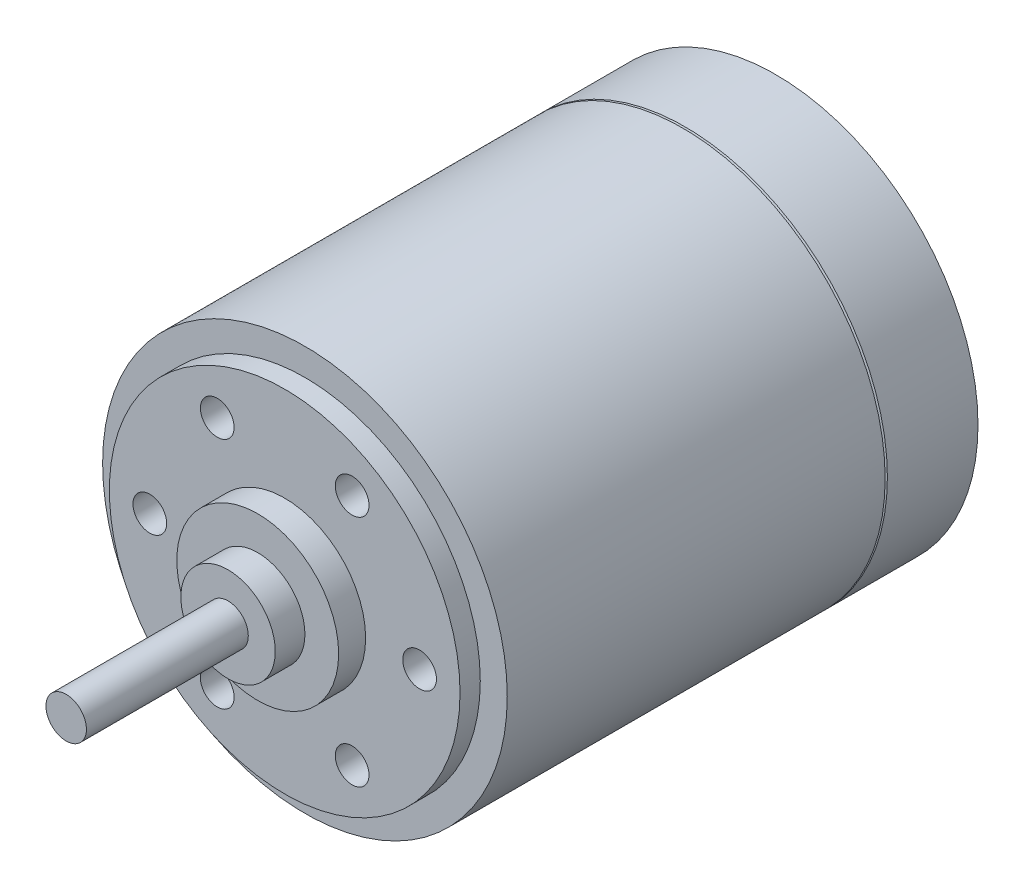
ISO-10303-21;
HEADER;
FILE_DESCRIPTION(('STEP AP214'),'2;1');
FILE_NAME('part.step','',(''),(''),'','','');
FILE_SCHEMA(('AUTOMOTIVE_DESIGN { 1 0 10303 214 1 1 1 1 }'));
ENDSEC;
DATA;
#1=APPLICATION_CONTEXT('core data for automotive mechanical design processes');
#2=APPLICATION_PROTOCOL_DEFINITION('international standard','automotive_design',2000,#1);
#3=PRODUCT_CONTEXT('',#1,'mechanical');
#4=PRODUCT('Part','Part','',(#3));
#5=PRODUCT_RELATED_PRODUCT_CATEGORY('part','',(#4));
#6=PRODUCT_DEFINITION_FORMATION('','',#4);
#7=PRODUCT_DEFINITION_CONTEXT('part definition',#1,'design');
#8=PRODUCT_DEFINITION('design','',#6,#7);
#9=PRODUCT_DEFINITION_SHAPE('','',#8);
#10=(LENGTH_UNIT() NAMED_UNIT(*) SI_UNIT(.MILLI.,.METRE.));
#11=(NAMED_UNIT(*) PLANE_ANGLE_UNIT() SI_UNIT($,.RADIAN.));
#12=(NAMED_UNIT(*) SI_UNIT($,.STERADIAN.) SOLID_ANGLE_UNIT());
#13=UNCERTAINTY_MEASURE_WITH_UNIT(LENGTH_MEASURE(1.E-05),#10,'distance_accuracy_value','');
#14=(GEOMETRIC_REPRESENTATION_CONTEXT(3) GLOBAL_UNCERTAINTY_ASSIGNED_CONTEXT((#13)) GLOBAL_UNIT_ASSIGNED_CONTEXT((#10,
#11,#12)) REPRESENTATION_CONTEXT('',''));
#15=CARTESIAN_POINT('',(0.,0.,0.));
#16=DIRECTION('',(0.,0.,1.));
#17=DIRECTION('',(1.,0.,0.));
#18=AXIS2_PLACEMENT_3D('',#15,#16,#17);
#19=CARTESIAN_POINT('',(0.,0.,-1.));
#20=DIRECTION('',(0.,0.,1.));
#21=DIRECTION('',(1.,0.,0.));
#22=AXIS2_PLACEMENT_3D('',#19,#20,#21);
#23=PLANE('',#22);
#24=DIRECTION('',(-1.,0.,0.));
#25=VECTOR('',#24,1.);
#26=CARTESIAN_POINT('',(0.,-5.8,-1.));
#27=LINE('',#26,#25);
#28=CARTESIAN_POINT('',(4.75499737118749,-5.8,-1.));
#29=VERTEX_POINT('',#28);
#30=CARTESIAN_POINT('',(-4.75499737118749,-5.8,-1.));
#31=VERTEX_POINT('',#30);
#32=EDGE_CURVE('E181',#29,#31,#27,.T.);
#33=ORIENTED_EDGE('',*,*,#32,.F.);
#34=CARTESIAN_POINT('',(0.,0.,-1.));
#35=DIRECTION('',(0.,0.,1.));
#36=DIRECTION('',(1.,0.,0.));
#37=AXIS2_PLACEMENT_3D('',#34,#35,#36);
#38=CIRCLE('',#37,7.5);
#39=EDGE_CURVE('E147',#31,#29,#38,.T.);
#40=ORIENTED_EDGE('',*,*,#39,.F.);
#41=EDGE_LOOP('',(#33,#40));
#42=FACE_BOUND('',#41,.T.);
#43=ADVANCED_FACE('F36',(#42),#23,.F.);
#44=CARTESIAN_POINT('',(-2.5,4.33012701892218,15.8));
#45=DIRECTION('',(0.,0.,-1.));
#46=DIRECTION('',(-0.5,0.866025403784439,0.));
#47=AXIS2_PLACEMENT_3D('',#44,#45,#46);
#48=CYLINDRICAL_SURFACE('',#47,0.625);
#49=CARTESIAN_POINT('',(-2.5,4.33012701892218,15.8));
#50=DIRECTION('',(0.,0.,-1.));
#51=DIRECTION('',(-0.5,0.866025403784439,0.));
#52=AXIS2_PLACEMENT_3D('',#49,#50,#51);
#53=CIRCLE('',#52,0.625);
#54=CARTESIAN_POINT('',(-2.8125,4.87139289628745,15.8));
#55=VERTEX_POINT('',#54);
#56=EDGE_CURVE('E156',#55,#55,#53,.T.);
#57=ORIENTED_EDGE('',*,*,#56,.F.);
#58=EDGE_LOOP('',(#57));
#59=FACE_BOUND('',#58,.T.);
#60=CARTESIAN_POINT('',(-2.5,4.33012701892218,13.8));
#61=DIRECTION('',(0.,0.,-1.));
#62=DIRECTION('',(-0.5,0.866025403784439,0.));
#63=AXIS2_PLACEMENT_3D('',#60,#61,#62);
#64=CIRCLE('',#63,0.625);
#65=CARTESIAN_POINT('',(-2.8125,4.87139289628745,13.8));
#66=VERTEX_POINT('',#65);
#67=EDGE_CURVE('E11',#66,#66,#64,.T.);
#68=ORIENTED_EDGE('',*,*,#67,.T.);
#69=EDGE_LOOP('',(#68));
#70=FACE_BOUND('',#69,.T.);
#71=ADVANCED_FACE('F238',(#59,#70),#48,.F.);
#72=CARTESIAN_POINT('',(-2.5,4.33012701892218,13.8));
#73=DIRECTION('',(0.,0.,1.));
#74=DIRECTION('',(0.5,-0.866025403784439,0.));
#75=AXIS2_PLACEMENT_3D('',#72,#73,#74);
#76=CONICAL_SURFACE('',#75,0.625,1.0297442575);
#77=CARTESIAN_POINT('',(-2.5,4.33012701892218,13.4244621131078));
#78=VERTEX_POINT('',#77);
#79=VERTEX_LOOP('',#78);
#80=FACE_BOUND('',#79,.T.);
#81=ORIENTED_EDGE('',*,*,#67,.F.);
#82=EDGE_LOOP('',(#81));
#83=FACE_BOUND('',#82,.T.);
#84=ADVANCED_FACE('F243',(#80,#83),#76,.F.);
#85=CARTESIAN_POINT('',(2.5,4.33012701892218,15.8));
#86=DIRECTION('',(0.,0.,-1.));
#87=DIRECTION('',(0.5,0.866025403784439,0.));
#88=AXIS2_PLACEMENT_3D('',#85,#86,#87);
#89=CYLINDRICAL_SURFACE('',#88,0.625);
#90=CARTESIAN_POINT('',(2.5,4.33012701892218,15.8));
#91=DIRECTION('',(0.,0.,-1.));
#92=DIRECTION('',(0.5,0.866025403784439,0.));
#93=AXIS2_PLACEMENT_3D('',#90,#91,#92);
#94=CIRCLE('',#93,0.625);
#95=CARTESIAN_POINT('',(2.8125,4.87139289628745,15.8));
#96=VERTEX_POINT('',#95);
#97=EDGE_CURVE('E158',#96,#96,#94,.T.);
#98=ORIENTED_EDGE('',*,*,#97,.F.);
#99=EDGE_LOOP('',(#98));
#100=FACE_BOUND('',#99,.T.);
#101=CARTESIAN_POINT('',(2.5,4.33012701892218,13.8));
#102=DIRECTION('',(0.,0.,-1.));
#103=DIRECTION('',(0.5,0.866025403784439,0.));
#104=AXIS2_PLACEMENT_3D('',#101,#102,#103);
#105=CIRCLE('',#104,0.625);
#106=CARTESIAN_POINT('',(2.8125,4.87139289628745,13.8));
#107=VERTEX_POINT('',#106);
#108=EDGE_CURVE('E46',#107,#107,#105,.T.);
#109=ORIENTED_EDGE('',*,*,#108,.T.);
#110=EDGE_LOOP('',(#109));
#111=FACE_BOUND('',#110,.T.);
#112=ADVANCED_FACE('F271',(#100,#111),#89,.F.);
#113=CARTESIAN_POINT('',(2.5,4.33012701892218,13.8));
#114=DIRECTION('',(0.,0.,1.));
#115=DIRECTION('',(-0.5,-0.866025403784439,0.));
#116=AXIS2_PLACEMENT_3D('',#113,#114,#115);
#117=CONICAL_SURFACE('',#116,0.625,1.0297442575);
#118=CARTESIAN_POINT('',(2.5,4.33012701892218,13.4244621131078));
#119=VERTEX_POINT('',#118);
#120=VERTEX_LOOP('',#119);
#121=FACE_BOUND('',#120,.T.);
#122=ORIENTED_EDGE('',*,*,#108,.F.);
#123=EDGE_LOOP('',(#122));
#124=FACE_BOUND('',#123,.T.);
#125=ADVANCED_FACE('F268',(#121,#124),#117,.F.);
#126=CARTESIAN_POINT('',(5.,0.,15.8));
#127=DIRECTION('',(0.,0.,-1.));
#128=DIRECTION('',(1.,0.,0.));
#129=AXIS2_PLACEMENT_3D('',#126,#127,#128);
#130=CYLINDRICAL_SURFACE('',#129,0.625);
#131=CARTESIAN_POINT('',(5.,0.,15.8));
#132=DIRECTION('',(0.,0.,-1.));
#133=DIRECTION('',(1.,0.,0.));
#134=AXIS2_PLACEMENT_3D('',#131,#132,#133);
#135=CIRCLE('',#134,0.625);
#136=CARTESIAN_POINT('',(5.625,0.,15.8));
#137=VERTEX_POINT('',#136);
#138=EDGE_CURVE('E161',#137,#137,#135,.T.);
#139=ORIENTED_EDGE('',*,*,#138,.F.);
#140=EDGE_LOOP('',(#139));
#141=FACE_BOUND('',#140,.T.);
#142=CARTESIAN_POINT('',(5.,0.,13.8));
#143=DIRECTION('',(0.,0.,-1.));
#144=DIRECTION('',(1.,0.,0.));
#145=AXIS2_PLACEMENT_3D('',#142,#143,#144);
#146=CIRCLE('',#145,0.625);
#147=CARTESIAN_POINT('',(5.625,0.,13.8));
#148=VERTEX_POINT('',#147);
#149=EDGE_CURVE('E175',#148,#148,#146,.T.);
#150=ORIENTED_EDGE('',*,*,#149,.T.);
#151=EDGE_LOOP('',(#150));
#152=FACE_BOUND('',#151,.T.);
#153=ADVANCED_FACE('F270',(#141,#152),#130,.F.);
#154=CARTESIAN_POINT('',(5.,0.,13.8));
#155=DIRECTION('',(0.,0.,1.));
#156=DIRECTION('',(-1.,0.,0.));
#157=AXIS2_PLACEMENT_3D('',#154,#155,#156);
#158=CONICAL_SURFACE('',#157,0.625,1.0297442575);
#159=CARTESIAN_POINT('',(5.,0.,13.4244621131078));
#160=VERTEX_POINT('',#159);
#161=VERTEX_LOOP('',#160);
#162=FACE_BOUND('',#161,.T.);
#163=ORIENTED_EDGE('',*,*,#149,.F.);
#164=EDGE_LOOP('',(#163));
#165=FACE_BOUND('',#164,.T.);
#166=ADVANCED_FACE('F285',(#162,#165),#158,.F.);
#167=CARTESIAN_POINT('',(2.5,-4.33012701892217,15.8));
#168=DIRECTION('',(0.,0.,-1.));
#169=DIRECTION('',(0.5,-0.866025403784439,0.));
#170=AXIS2_PLACEMENT_3D('',#167,#168,#169);
#171=CYLINDRICAL_SURFACE('',#170,0.625);
#172=CARTESIAN_POINT('',(2.5,-4.33012701892217,15.8));
#173=DIRECTION('',(0.,0.,-1.));
#174=DIRECTION('',(0.5,-0.866025403784439,0.));
#175=AXIS2_PLACEMENT_3D('',#172,#173,#174);
#176=CIRCLE('',#175,0.625);
#177=CARTESIAN_POINT('',(2.8125,-4.87139289628745,15.8));
#178=VERTEX_POINT('',#177);
#179=EDGE_CURVE('E163',#178,#178,#176,.T.);
#180=ORIENTED_EDGE('',*,*,#179,.F.);
#181=EDGE_LOOP('',(#180));
#182=FACE_BOUND('',#181,.T.);
#183=CARTESIAN_POINT('',(2.5,-4.33012701892218,13.8));
#184=DIRECTION('',(0.,0.,-1.));
#185=DIRECTION('',(0.5,-0.866025403784439,0.));
#186=AXIS2_PLACEMENT_3D('',#183,#184,#185);
#187=CIRCLE('',#186,0.625);
#188=CARTESIAN_POINT('',(2.8125,-4.87139289628745,13.8));
#189=VERTEX_POINT('',#188);
#190=EDGE_CURVE('E178',#189,#189,#187,.T.);
#191=ORIENTED_EDGE('',*,*,#190,.T.);
#192=EDGE_LOOP('',(#191));
#193=FACE_BOUND('',#192,.T.);
#194=ADVANCED_FACE('F276',(#182,#193),#171,.F.);
#195=CARTESIAN_POINT('',(2.5,-4.33012701892218,13.8));
#196=DIRECTION('',(0.,0.,1.));
#197=DIRECTION('',(-0.5,0.866025403784439,0.));
#198=AXIS2_PLACEMENT_3D('',#195,#196,#197);
#199=CONICAL_SURFACE('',#198,0.625,1.0297442575);
#200=CARTESIAN_POINT('',(2.5,-4.33012701892218,13.4244621131078));
#201=VERTEX_POINT('',#200);
#202=VERTEX_LOOP('',#201);
#203=FACE_BOUND('',#202,.T.);
#204=ORIENTED_EDGE('',*,*,#190,.F.);
#205=EDGE_LOOP('',(#204));
#206=FACE_BOUND('',#205,.T.);
#207=ADVANCED_FACE('F262',(#203,#206),#199,.F.);
#208=CARTESIAN_POINT('',(-2.5,-4.33012701892217,15.8));
#209=DIRECTION('',(0.,0.,-1.));
#210=DIRECTION('',(-0.5,-0.866025403784439,0.));
#211=AXIS2_PLACEMENT_3D('',#208,#209,#210);
#212=CYLINDRICAL_SURFACE('',#211,0.625);
#213=CARTESIAN_POINT('',(-2.5,-4.33012701892217,15.8));
#214=DIRECTION('',(0.,0.,-1.));
#215=DIRECTION('',(-0.5,-0.866025403784439,0.));
#216=AXIS2_PLACEMENT_3D('',#213,#214,#215);
#217=CIRCLE('',#216,0.625);
#218=CARTESIAN_POINT('',(-2.8125,-4.87139289628745,15.8));
#219=VERTEX_POINT('',#218);
#220=EDGE_CURVE('E155',#219,#219,#217,.T.);
#221=ORIENTED_EDGE('',*,*,#220,.F.);
#222=EDGE_LOOP('',(#221));
#223=FACE_BOUND('',#222,.T.);
#224=CARTESIAN_POINT('',(-2.5,-4.33012701892218,13.8));
#225=DIRECTION('',(0.,0.,-1.));
#226=DIRECTION('',(-0.5,-0.866025403784439,0.));
#227=AXIS2_PLACEMENT_3D('',#224,#225,#226);
#228=CIRCLE('',#227,0.625);
#229=CARTESIAN_POINT('',(-2.8125,-4.87139289628745,13.8));
#230=VERTEX_POINT('',#229);
#231=EDGE_CURVE('E150',#230,#230,#228,.T.);
#232=ORIENTED_EDGE('',*,*,#231,.T.);
#233=EDGE_LOOP('',(#232));
#234=FACE_BOUND('',#233,.T.);
#235=ADVANCED_FACE('F258',(#223,#234),#212,.F.);
#236=CARTESIAN_POINT('',(-2.5,-4.33012701892218,13.8));
#237=DIRECTION('',(0.,0.,1.));
#238=DIRECTION('',(0.5,0.866025403784439,0.));
#239=AXIS2_PLACEMENT_3D('',#236,#237,#238);
#240=CONICAL_SURFACE('',#239,0.625,1.0297442575);
#241=CARTESIAN_POINT('',(-2.5,-4.33012701892218,13.4244621131078));
#242=VERTEX_POINT('',#241);
#243=VERTEX_LOOP('',#242);
#244=FACE_BOUND('',#243,.T.);
#245=ORIENTED_EDGE('',*,*,#231,.F.);
#246=EDGE_LOOP('',(#245));
#247=FACE_BOUND('',#246,.T.);
#248=ADVANCED_FACE('F254',(#244,#247),#240,.F.);
#249=CARTESIAN_POINT('',(-5.,0.,15.8));
#250=DIRECTION('',(0.,0.,-1.));
#251=DIRECTION('',(-1.,0.,0.));
#252=AXIS2_PLACEMENT_3D('',#249,#250,#251);
#253=CYLINDRICAL_SURFACE('',#252,0.625);
#254=CARTESIAN_POINT('',(-5.,0.,15.8));
#255=DIRECTION('',(0.,0.,-1.));
#256=DIRECTION('',(-1.,0.,0.));
#257=AXIS2_PLACEMENT_3D('',#254,#255,#256);
#258=CIRCLE('',#257,0.625);
#259=CARTESIAN_POINT('',(-5.625,0.,15.8));
#260=VERTEX_POINT('',#259);
#261=EDGE_CURVE('E153',#260,#260,#258,.T.);
#262=ORIENTED_EDGE('',*,*,#261,.F.);
#263=EDGE_LOOP('',(#262));
#264=FACE_BOUND('',#263,.T.);
#265=CARTESIAN_POINT('',(-5.,0.,13.8));
#266=DIRECTION('',(0.,0.,-1.));
#267=DIRECTION('',(-1.,0.,0.));
#268=AXIS2_PLACEMENT_3D('',#265,#266,#267);
#269=CIRCLE('',#268,0.625);
#270=CARTESIAN_POINT('',(-5.625,0.,13.8));
#271=VERTEX_POINT('',#270);
#272=EDGE_CURVE('E148',#271,#271,#269,.T.);
#273=ORIENTED_EDGE('',*,*,#272,.T.);
#274=EDGE_LOOP('',(#273));
#275=FACE_BOUND('',#274,.T.);
#276=ADVANCED_FACE('F257',(#264,#275),#253,.F.);
#277=CARTESIAN_POINT('',(-5.,0.,13.8));
#278=DIRECTION('',(0.,0.,1.));
#279=DIRECTION('',(1.,0.,0.));
#280=AXIS2_PLACEMENT_3D('',#277,#278,#279);
#281=CONICAL_SURFACE('',#280,0.625,1.0297442575);
#282=CARTESIAN_POINT('',(-5.,0.,13.4244621131078));
#283=VERTEX_POINT('',#282);
#284=VERTEX_LOOP('',#283);
#285=FACE_BOUND('',#284,.T.);
#286=ORIENTED_EDGE('',*,*,#272,.F.);
#287=EDGE_LOOP('',(#286));
#288=FACE_BOUND('',#287,.T.);
#289=ADVANCED_FACE('F266',(#285,#288),#281,.F.);
#290=CARTESIAN_POINT('',(0.,0.,0.));
#291=DIRECTION('',(0.,0.,1.));
#292=DIRECTION('',(1.,0.,0.));
#293=AXIS2_PLACEMENT_3D('',#290,#291,#292);
#294=CYLINDRICAL_SURFACE('',#293,6.5);
#295=CARTESIAN_POINT('',(0.,0.,15.8));
#296=DIRECTION('',(0.,0.,1.));
#297=DIRECTION('',(1.,0.,0.));
#298=AXIS2_PLACEMENT_3D('',#295,#296,#297);
#299=CIRCLE('',#298,6.5);
#300=CARTESIAN_POINT('',(6.5,0.,15.8));
#301=VERTEX_POINT('',#300);
#302=EDGE_CURVE('E151',#301,#301,#299,.T.);
#303=ORIENTED_EDGE('',*,*,#302,.F.);
#304=EDGE_LOOP('',(#303));
#305=FACE_BOUND('',#304,.T.);
#306=CARTESIAN_POINT('',(0.,0.,15.05));
#307=DIRECTION('',(0.,0.,1.));
#308=DIRECTION('',(1.,0.,0.));
#309=AXIS2_PLACEMENT_3D('',#306,#307,#308);
#310=CIRCLE('',#309,6.5);
#311=CARTESIAN_POINT('',(6.5,0.,15.05));
#312=VERTEX_POINT('',#311);
#313=EDGE_CURVE('E40',#312,#312,#310,.T.);
#314=ORIENTED_EDGE('',*,*,#313,.T.);
#315=EDGE_LOOP('',(#314));
#316=FACE_BOUND('',#315,.T.);
#317=ADVANCED_FACE('F282',(#305,#316),#294,.T.);
#318=CARTESIAN_POINT('',(0.,3.,15.8));
#319=DIRECTION('',(0.,0.,1.));
#320=DIRECTION('',(1.,0.,0.));
#321=AXIS2_PLACEMENT_3D('',#318,#319,#320);
#322=PLANE('',#321);
#323=CARTESIAN_POINT('',(0.,0.,15.8));
#324=DIRECTION('',(0.,0.,1.));
#325=DIRECTION('',(1.,0.,0.));
#326=AXIS2_PLACEMENT_3D('',#323,#324,#325);
#327=CIRCLE('',#326,3.);
#328=CARTESIAN_POINT('',(3.,0.,15.8));
#329=VERTEX_POINT('',#328);
#330=EDGE_CURVE('E159',#329,#329,#327,.T.);
#331=ORIENTED_EDGE('',*,*,#330,.F.);
#332=EDGE_LOOP('',(#331));
#333=FACE_BOUND('',#332,.T.);
#334=ORIENTED_EDGE('',*,*,#302,.T.);
#335=EDGE_LOOP('',(#334));
#336=FACE_BOUND('',#335,.T.);
#337=ORIENTED_EDGE('',*,*,#261,.T.);
#338=EDGE_LOOP('',(#337));
#339=FACE_BOUND('',#338,.T.);
#340=ORIENTED_EDGE('',*,*,#220,.T.);
#341=EDGE_LOOP('',(#340));
#342=FACE_BOUND('',#341,.T.);
#343=ORIENTED_EDGE('',*,*,#179,.T.);
#344=EDGE_LOOP('',(#343));
#345=FACE_BOUND('',#344,.T.);
#346=ORIENTED_EDGE('',*,*,#138,.T.);
#347=EDGE_LOOP('',(#346));
#348=FACE_BOUND('',#347,.T.);
#349=ORIENTED_EDGE('',*,*,#97,.T.);
#350=EDGE_LOOP('',(#349));
#351=FACE_BOUND('',#350,.T.);
#352=ORIENTED_EDGE('',*,*,#56,.T.);
#353=EDGE_LOOP('',(#352));
#354=FACE_BOUND('',#353,.T.);
#355=ADVANCED_FACE('F252',(#333,#336,#339,#342,#345,#348,#351,#354),#322,.T.);
#356=CARTESIAN_POINT('',(0.,0.,0.));
#357=DIRECTION('',(0.,0.,1.));
#358=DIRECTION('',(1.,0.,0.));
#359=AXIS2_PLACEMENT_3D('',#356,#357,#358);
#360=CYLINDRICAL_SURFACE('',#359,3.);
#361=CARTESIAN_POINT('',(0.,0.,16.8));
#362=DIRECTION('',(0.,0.,1.));
#363=DIRECTION('',(1.,0.,0.));
#364=AXIS2_PLACEMENT_3D('',#361,#362,#363);
#365=CIRCLE('',#364,3.);
#366=CARTESIAN_POINT('',(3.,0.,16.8));
#367=VERTEX_POINT('',#366);
#368=EDGE_CURVE('E141',#367,#367,#365,.T.);
#369=ORIENTED_EDGE('',*,*,#368,.F.);
#370=EDGE_LOOP('',(#369));
#371=FACE_BOUND('',#370,.T.);
#372=ORIENTED_EDGE('',*,*,#330,.T.);
#373=EDGE_LOOP('',(#372));
#374=FACE_BOUND('',#373,.T.);
#375=ADVANCED_FACE('F248',(#371,#374),#360,.T.);
#376=CARTESIAN_POINT('',(0.,1.75,16.8));
#377=DIRECTION('',(0.,0.,1.));
#378=DIRECTION('',(1.,0.,0.));
#379=AXIS2_PLACEMENT_3D('',#376,#377,#378);
#380=PLANE('',#379);
#381=CARTESIAN_POINT('',(0.,0.,16.8));
#382=DIRECTION('',(0.,0.,1.));
#383=DIRECTION('',(1.,0.,0.));
#384=AXIS2_PLACEMENT_3D('',#381,#382,#383);
#385=CIRCLE('',#384,1.75);
#386=CARTESIAN_POINT('',(1.75000000000003,0.,16.8));
#387=VERTEX_POINT('',#386);
#388=EDGE_CURVE('E139',#387,#387,#385,.T.);
#389=ORIENTED_EDGE('',*,*,#388,.F.);
#390=EDGE_LOOP('',(#389));
#391=FACE_BOUND('',#390,.T.);
#392=ORIENTED_EDGE('',*,*,#368,.T.);
#393=EDGE_LOOP('',(#392));
#394=FACE_BOUND('',#393,.T.);
#395=ADVANCED_FACE('F251',(#391,#394),#380,.T.);
#396=CARTESIAN_POINT('',(0.,0.,0.));
#397=DIRECTION('',(0.,0.,1.));
#398=DIRECTION('',(1.,0.,0.));
#399=AXIS2_PLACEMENT_3D('',#396,#397,#398);
#400=CYLINDRICAL_SURFACE('',#399,1.75);
#401=CARTESIAN_POINT('',(0.,0.,17.9));
#402=DIRECTION('',(0.,0.,1.));
#403=DIRECTION('',(1.,0.,0.));
#404=AXIS2_PLACEMENT_3D('',#401,#402,#403);
#405=CIRCLE('',#404,1.75);
#406=CARTESIAN_POINT('',(1.75000000000003,0.,17.9));
#407=VERTEX_POINT('',#406);
#408=EDGE_CURVE('E136',#407,#407,#405,.T.);
#409=ORIENTED_EDGE('',*,*,#408,.F.);
#410=EDGE_LOOP('',(#409));
#411=FACE_BOUND('',#410,.T.);
#412=ORIENTED_EDGE('',*,*,#388,.T.);
#413=EDGE_LOOP('',(#412));
#414=FACE_BOUND('',#413,.T.);
#415=ADVANCED_FACE('F319',(#411,#414),#400,.T.);
#416=CARTESIAN_POINT('',(0.,0.75,17.9));
#417=DIRECTION('',(0.,0.,1.));
#418=DIRECTION('',(1.,0.,0.));
#419=AXIS2_PLACEMENT_3D('',#416,#417,#418);
#420=PLANE('',#419);
#421=CARTESIAN_POINT('',(0.,0.,17.9));
#422=DIRECTION('',(0.,0.,1.));
#423=DIRECTION('',(1.,0.,0.));
#424=AXIS2_PLACEMENT_3D('',#421,#422,#423);
#425=CIRCLE('',#424,0.75);
#426=CARTESIAN_POINT('',(0.750000000000028,0.,17.9));
#427=VERTEX_POINT('',#426);
#428=EDGE_CURVE('E140',#427,#427,#425,.T.);
#429=ORIENTED_EDGE('',*,*,#428,.F.);
#430=EDGE_LOOP('',(#429));
#431=FACE_BOUND('',#430,.T.);
#432=ORIENTED_EDGE('',*,*,#408,.T.);
#433=EDGE_LOOP('',(#432));
#434=FACE_BOUND('',#433,.T.);
#435=ADVANCED_FACE('F137',(#431,#434),#420,.T.);
#436=CARTESIAN_POINT('',(0.,0.,0.));
#437=DIRECTION('',(0.,0.,1.));
#438=DIRECTION('',(1.,0.,0.));
#439=AXIS2_PLACEMENT_3D('',#436,#437,#438);
#440=CYLINDRICAL_SURFACE('',#439,0.75);
#441=CARTESIAN_POINT('',(0.,0.,23.9));
#442=DIRECTION('',(0.,0.,1.));
#443=DIRECTION('',(1.,0.,0.));
#444=AXIS2_PLACEMENT_3D('',#441,#442,#443);
#445=CIRCLE('',#444,0.75);
#446=CARTESIAN_POINT('',(0.750000000000036,0.,23.9));
#447=VERTEX_POINT('',#446);
#448=EDGE_CURVE('E143',#447,#447,#445,.T.);
#449=ORIENTED_EDGE('',*,*,#448,.F.);
#450=EDGE_LOOP('',(#449));
#451=FACE_BOUND('',#450,.T.);
#452=ORIENTED_EDGE('',*,*,#428,.T.);
#453=EDGE_LOOP('',(#452));
#454=FACE_BOUND('',#453,.T.);
#455=ADVANCED_FACE('F234',(#451,#454),#440,.T.);
#456=CARTESIAN_POINT('',(0.,0.,23.9));
#457=DIRECTION('',(0.,0.,1.));
#458=DIRECTION('',(1.,0.,0.));
#459=AXIS2_PLACEMENT_3D('',#456,#457,#458);
#460=PLANE('',#459);
#461=ORIENTED_EDGE('',*,*,#448,.T.);
#462=EDGE_LOOP('',(#461));
#463=FACE_BOUND('',#462,.T.);
#464=ADVANCED_FACE('F230',(#463),#460,.T.);
#465=CARTESIAN_POINT('',(0.,0.,0.));
#466=DIRECTION('',(0.,0.,1.));
#467=DIRECTION('',(1.,0.,0.));
#468=AXIS2_PLACEMENT_3D('',#465,#466,#467);
#469=CYLINDRICAL_SURFACE('',#468,7.5);
#470=DIRECTION('',(0.,0.,1.));
#471=VECTOR('',#470,1.);
#472=CARTESIAN_POINT('',(-4.7549973711875,-5.8,-2.39999999999999));
#473=LINE('',#472,#471);
#474=CARTESIAN_POINT('',(-4.7549973711875,-5.8,-2.39999999999999));
#475=VERTEX_POINT('',#474);
#476=EDGE_CURVE('E192',#475,#31,#473,.T.);
#477=ORIENTED_EDGE('',*,*,#476,.T.);
#478=ORIENTED_EDGE('',*,*,#39,.T.);
#479=DIRECTION('',(0.,0.,1.));
#480=VECTOR('',#479,1.);
#481=CARTESIAN_POINT('',(4.75499737118749,-5.8,-2.40000000000001));
#482=LINE('',#481,#480);
#483=CARTESIAN_POINT('',(4.75499737118749,-5.8,-2.40000000000001));
#484=VERTEX_POINT('',#483);
#485=EDGE_CURVE('E189',#484,#29,#482,.T.);
#486=ORIENTED_EDGE('',*,*,#485,.F.);
#487=CARTESIAN_POINT('',(0.,0.,-2.4));
#488=DIRECTION('',(0.,0.,-1.));
#489=DIRECTION('',(-1.,0.,0.));
#490=AXIS2_PLACEMENT_3D('',#487,#488,#489);
#491=CIRCLE('',#490,7.5);
#492=EDGE_CURVE('E198',#475,#484,#491,.T.);
#493=ORIENTED_EDGE('',*,*,#492,.F.);
#494=EDGE_LOOP('',(#477,#478,#486,#493));
#495=FACE_BOUND('',#494,.T.);
#496=CARTESIAN_POINT('',(0.,0.,0.95857864376269));
#497=DIRECTION('',(0.,0.,1.));
#498=DIRECTION('',(1.,0.,0.));
#499=AXIS2_PLACEMENT_3D('',#496,#497,#498);
#500=CIRCLE('',#499,7.5);
#501=CARTESIAN_POINT('',(7.5,0.,0.95857864376268));
#502=VERTEX_POINT('',#501);
#503=EDGE_CURVE('E166',#502,#502,#500,.T.);
#504=ORIENTED_EDGE('',*,*,#503,.F.);
#505=EDGE_LOOP('',(#504));
#506=FACE_BOUND('',#505,.T.);
#507=ADVANCED_FACE('F38',(#495,#506),#469,.T.);
#508=CARTESIAN_POINT('',(0.,0.,1.));
#509=DIRECTION('',(0.,0.,-1.));
#510=DIRECTION('',(-1.,0.,0.));
#511=AXIS2_PLACEMENT_3D('',#508,#509,#510);
#512=CONICAL_SURFACE('',#511,7.4,1.17809724375);
#513=CARTESIAN_POINT('',(0.,0.,1.));
#514=DIRECTION('',(0.,0.,1.));
#515=DIRECTION('',(1.,0.,0.));
#516=AXIS2_PLACEMENT_3D('',#513,#514,#515);
#517=CIRCLE('',#516,7.4);
#518=CARTESIAN_POINT('',(7.4,0.,1.));
#519=VERTEX_POINT('',#518);
#520=EDGE_CURVE('E170',#519,#519,#517,.T.);
#521=ORIENTED_EDGE('',*,*,#520,.F.);
#522=EDGE_LOOP('',(#521));
#523=FACE_BOUND('',#522,.T.);
#524=ORIENTED_EDGE('',*,*,#503,.T.);
#525=EDGE_LOOP('',(#524));
#526=FACE_BOUND('',#525,.T.);
#527=ADVANCED_FACE('F224',(#523,#526),#512,.T.);
#528=CARTESIAN_POINT('',(0.,0.,1.04142135623731));
#529=DIRECTION('',(0.,0.,1.));
#530=DIRECTION('',(1.,0.,0.));
#531=AXIS2_PLACEMENT_3D('',#528,#529,#530);
#532=CONICAL_SURFACE('',#531,7.5,1.17809724375001);
#533=CARTESIAN_POINT('',(0.,0.,1.04142135623731));
#534=DIRECTION('',(0.,0.,1.));
#535=DIRECTION('',(1.,0.,0.));
#536=AXIS2_PLACEMENT_3D('',#533,#534,#535);
#537=CIRCLE('',#536,7.5);
#538=CARTESIAN_POINT('',(7.5,0.,1.0414213562373));
#539=VERTEX_POINT('',#538);
#540=EDGE_CURVE('E172',#539,#539,#537,.T.);
#541=ORIENTED_EDGE('',*,*,#540,.F.);
#542=EDGE_LOOP('',(#541));
#543=FACE_BOUND('',#542,.T.);
#544=ORIENTED_EDGE('',*,*,#520,.T.);
#545=EDGE_LOOP('',(#544));
#546=FACE_BOUND('',#545,.T.);
#547=ADVANCED_FACE('F222',(#543,#546),#532,.T.);
#548=CARTESIAN_POINT('',(0.,0.,0.));
#549=DIRECTION('',(0.,0.,1.));
#550=DIRECTION('',(1.,0.,0.));
#551=AXIS2_PLACEMENT_3D('',#548,#549,#550);
#552=CYLINDRICAL_SURFACE('',#551,7.5);
#553=CARTESIAN_POINT('',(0.,0.,15.05));
#554=DIRECTION('',(0.,0.,1.));
#555=DIRECTION('',(1.,0.,0.));
#556=AXIS2_PLACEMENT_3D('',#553,#554,#555);
#557=CIRCLE('',#556,7.5);
#558=CARTESIAN_POINT('',(7.5,0.,15.05));
#559=VERTEX_POINT('',#558);
#560=EDGE_CURVE('E179',#559,#559,#557,.T.);
#561=ORIENTED_EDGE('',*,*,#560,.F.);
#562=EDGE_LOOP('',(#561));
#563=FACE_BOUND('',#562,.T.);
#564=ORIENTED_EDGE('',*,*,#540,.T.);
#565=EDGE_LOOP('',(#564));
#566=FACE_BOUND('',#565,.T.);
#567=ADVANCED_FACE('F324',(#563,#566),#552,.T.);
#568=CARTESIAN_POINT('',(0.,6.5,15.05));
#569=DIRECTION('',(0.,0.,1.));
#570=DIRECTION('',(1.,0.,0.));
#571=AXIS2_PLACEMENT_3D('',#568,#569,#570);
#572=PLANE('',#571);
#573=ORIENTED_EDGE('',*,*,#313,.F.);
#574=EDGE_LOOP('',(#573));
#575=FACE_BOUND('',#574,.T.);
#576=ORIENTED_EDGE('',*,*,#560,.T.);
#577=EDGE_LOOP('',(#576));
#578=FACE_BOUND('',#577,.T.);
#579=ADVANCED_FACE('F326',(#575,#578),#572,.T.);
#580=CARTESIAN_POINT('',(4.75499737118749,-5.8,-2.40000000000001));
#581=DIRECTION('',(0.,1.,0.));
#582=DIRECTION('',(-1.,0.,0.));
#583=AXIS2_PLACEMENT_3D('',#580,#581,#582);
#584=PLANE('',#583);
#585=ORIENTED_EDGE('',*,*,#485,.T.);
#586=ORIENTED_EDGE('',*,*,#32,.T.);
#587=ORIENTED_EDGE('',*,*,#476,.F.);
#588=DIRECTION('',(-1.,0.,0.));
#589=VECTOR('',#588,1.);
#590=CARTESIAN_POINT('',(4.75499737118749,-5.8,-2.40000000000001));
#591=LINE('',#590,#589);
#592=EDGE_CURVE('E195',#484,#475,#591,.T.);
#593=ORIENTED_EDGE('',*,*,#592,.F.);
#594=EDGE_LOOP('',(#585,#586,#587,#593));
#595=FACE_BOUND('',#594,.T.);
#596=ADVANCED_FACE('F215',(#595),#584,.F.);
#597=CARTESIAN_POINT('',(0.,0.,-2.4));
#598=DIRECTION('',(0.,0.,-1.));
#599=DIRECTION('',(-1.,0.,0.));
#600=AXIS2_PLACEMENT_3D('',#597,#598,#599);
#601=PLANE('',#600);
#602=ORIENTED_EDGE('',*,*,#492,.T.);
#603=ORIENTED_EDGE('',*,*,#592,.T.);
#604=EDGE_LOOP('',(#602,#603));
#605=FACE_BOUND('',#604,.T.);
#606=ADVANCED_FACE('F204',(#605),#601,.T.);
#607=CLOSED_SHELL('',(#43,#71,#84,#112,#125,#153,#166,#194,#207,#235,#248,#276,#289,#317,#355,
#375,#395,#415,#435,#455,#464,#507,#527,#547,#567,#579,#596,#606));
#608=MANIFOLD_SOLID_BREP('B2',#607);
#609=ADVANCED_BREP_SHAPE_REPRESENTATION('',(#18,#608),#14);
#610=SHAPE_DEFINITION_REPRESENTATION(#9,#609);
ENDSEC;
END-ISO-10303-21;
